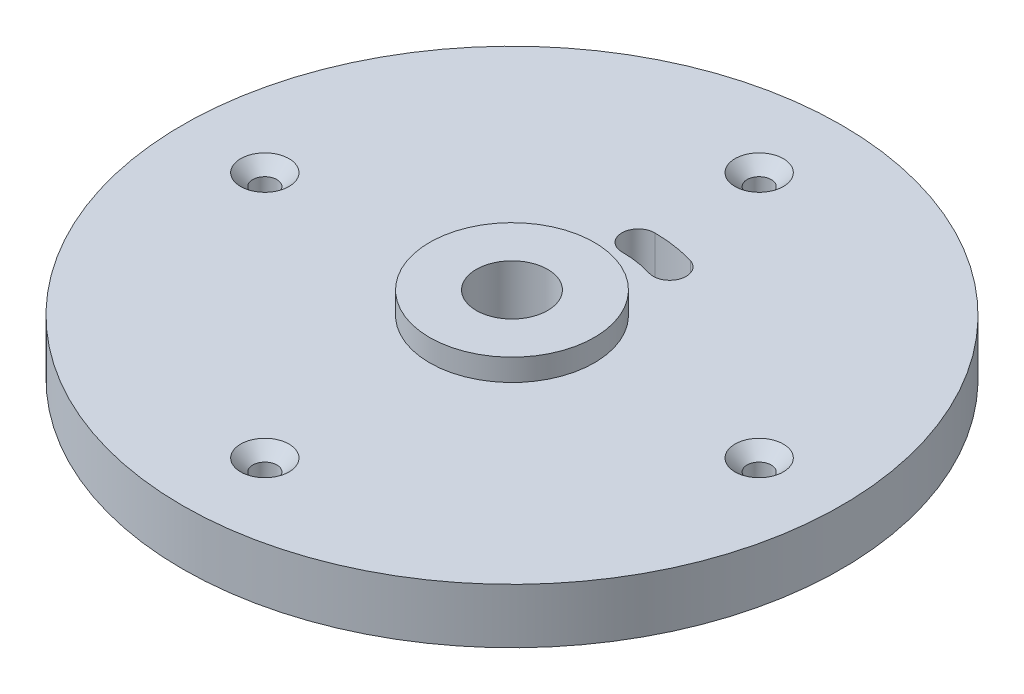
ISO-10303-21;
HEADER;
FILE_DESCRIPTION(('STEP AP214'),'2;1');
FILE_NAME('part.step','',(''),(''),'','','');
FILE_SCHEMA(('AUTOMOTIVE_DESIGN { 1 0 10303 214 1 1 1 1 }'));
ENDSEC;
DATA;
#1=APPLICATION_CONTEXT('core data for automotive mechanical design processes');
#2=APPLICATION_PROTOCOL_DEFINITION('international standard','automotive_design',2000,#1);
#3=PRODUCT_CONTEXT('',#1,'mechanical');
#4=PRODUCT('Part','Part','',(#3));
#5=PRODUCT_RELATED_PRODUCT_CATEGORY('part','',(#4));
#6=PRODUCT_DEFINITION_FORMATION('','',#4);
#7=PRODUCT_DEFINITION_CONTEXT('part definition',#1,'design');
#8=PRODUCT_DEFINITION('design','',#6,#7);
#9=PRODUCT_DEFINITION_SHAPE('','',#8);
#10=(LENGTH_UNIT() NAMED_UNIT(*) SI_UNIT(.MILLI.,.METRE.));
#11=(NAMED_UNIT(*) PLANE_ANGLE_UNIT() SI_UNIT($,.RADIAN.));
#12=(NAMED_UNIT(*) SI_UNIT($,.STERADIAN.) SOLID_ANGLE_UNIT());
#13=UNCERTAINTY_MEASURE_WITH_UNIT(LENGTH_MEASURE(1.E-05),#10,'distance_accuracy_value','');
#14=(GEOMETRIC_REPRESENTATION_CONTEXT(3) GLOBAL_UNCERTAINTY_ASSIGNED_CONTEXT((#13)) GLOBAL_UNIT_ASSIGNED_CONTEXT((#10,
#11,#12)) REPRESENTATION_CONTEXT('',''));
#15=CARTESIAN_POINT('',(0.,0.,0.));
#16=DIRECTION('',(0.,0.,1.));
#17=DIRECTION('',(1.,0.,0.));
#18=AXIS2_PLACEMENT_3D('',#15,#16,#17);
#19=CARTESIAN_POINT('',(30.,14.,0.));
#20=DIRECTION('',(0.,1.,0.));
#21=DIRECTION('',(0.,0.,1.));
#22=AXIS2_PLACEMENT_3D('',#19,#20,#21);
#23=PLANE('',#22);
#24=CARTESIAN_POINT('',(-22.5,14.,7.07024971115735E-13));
#25=DIRECTION('',(0.,1.,0.));
#26=DIRECTION('',(0.,0.,1.));
#27=AXIS2_PLACEMENT_3D('',#24,#25,#26);
#28=CIRCLE('',#27,2.2);
#29=CARTESIAN_POINT('',(-22.5,14.,2.20000000000071));
#30=VERTEX_POINT('',#29);
#31=EDGE_CURVE('E148',#30,#30,#28,.T.);
#32=ORIENTED_EDGE('',*,*,#31,.F.);
#33=EDGE_LOOP('',(#32));
#34=FACE_BOUND('',#33,.T.);
#35=CARTESIAN_POINT('',(0.,14.,22.5));
#36=DIRECTION('',(0.,1.,0.));
#37=DIRECTION('',(0.,0.,1.));
#38=AXIS2_PLACEMENT_3D('',#35,#36,#37);
#39=CIRCLE('',#38,2.2);
#40=CARTESIAN_POINT('',(0.,14.,24.7));
#41=VERTEX_POINT('',#40);
#42=EDGE_CURVE('E152',#41,#41,#39,.T.);
#43=ORIENTED_EDGE('',*,*,#42,.F.);
#44=EDGE_LOOP('',(#43));
#45=FACE_BOUND('',#44,.T.);
#46=CARTESIAN_POINT('',(22.5,14.,-2.35674990371912E-13));
#47=DIRECTION('',(0.,1.,0.));
#48=DIRECTION('',(0.,0.,1.));
#49=AXIS2_PLACEMENT_3D('',#46,#47,#48);
#50=CIRCLE('',#49,2.2);
#51=CARTESIAN_POINT('',(22.5,14.,2.19999999999977));
#52=VERTEX_POINT('',#51);
#53=EDGE_CURVE('E156',#52,#52,#50,.T.);
#54=ORIENTED_EDGE('',*,*,#53,.F.);
#55=EDGE_LOOP('',(#54));
#56=FACE_BOUND('',#55,.T.);
#57=CARTESIAN_POINT('',(0.,14.,-22.5));
#58=DIRECTION('',(0.,1.,0.));
#59=DIRECTION('',(0.,0.,1.));
#60=AXIS2_PLACEMENT_3D('',#57,#58,#59);
#61=CIRCLE('',#60,2.2);
#62=CARTESIAN_POINT('',(0.,14.,-20.3));
#63=VERTEX_POINT('',#62);
#64=EDGE_CURVE('E160',#63,#63,#61,.T.);
#65=ORIENTED_EDGE('',*,*,#64,.F.);
#66=EDGE_LOOP('',(#65));
#67=FACE_BOUND('',#66,.T.);
#68=CARTESIAN_POINT('',(0.,14.,0.));
#69=DIRECTION('',(0.,1.,0.));
#70=DIRECTION('',(0.,0.,1.));
#71=AXIS2_PLACEMENT_3D('',#68,#69,#70);
#72=CIRCLE('',#71,7.5);
#73=CARTESIAN_POINT('',(0.,14.,7.5));
#74=VERTEX_POINT('',#73);
#75=EDGE_CURVE('E11',#74,#74,#72,.T.);
#76=ORIENTED_EDGE('',*,*,#75,.F.);
#77=EDGE_LOOP('',(#76));
#78=FACE_BOUND('',#77,.T.);
#79=CARTESIAN_POINT('',(0.,14.,0.));
#80=DIRECTION('',(0.,1.,0.));
#81=DIRECTION('',(0.,0.,1.));
#82=AXIS2_PLACEMENT_3D('',#79,#80,#81);
#83=CIRCLE('',#82,10.);
#84=CARTESIAN_POINT('',(0.,14.,-10.));
#85=VERTEX_POINT('',#84);
#86=CARTESIAN_POINT('',(2.9237170472273,14.,-9.56304755963038));
#87=VERTEX_POINT('',#86);
#88=EDGE_CURVE('E106',#85,#87,#83,.F.);
#89=ORIENTED_EDGE('',*,*,#88,.F.);
#90=CARTESIAN_POINT('',(0.,14.,-11.5));
#91=DIRECTION('',(0.,1.,0.));
#92=DIRECTION('',(0.,0.,1.));
#93=AXIS2_PLACEMENT_3D('',#90,#91,#92);
#94=CIRCLE('',#93,1.5);
#95=CARTESIAN_POINT('',(0.,14.,-13.));
#96=VERTEX_POINT('',#95);
#97=EDGE_CURVE('E109',#96,#85,#94,.T.);
#98=ORIENTED_EDGE('',*,*,#97,.F.);
#99=CARTESIAN_POINT('',(0.,14.,0.));
#100=DIRECTION('',(0.,1.,0.));
#101=DIRECTION('',(0.,0.,1.));
#102=AXIS2_PLACEMENT_3D('',#99,#100,#101);
#103=CIRCLE('',#102,13.);
#104=CARTESIAN_POINT('',(3.80083216139549,14.,-12.4319618275195));
#105=VERTEX_POINT('',#104);
#106=EDGE_CURVE('E90',#105,#96,#103,.T.);
#107=ORIENTED_EDGE('',*,*,#106,.F.);
#108=CARTESIAN_POINT('',(3.3622746043114,14.,-10.9975046935749));
#109=DIRECTION('',(0.,1.,0.));
#110=DIRECTION('',(0.,0.,1.));
#111=AXIS2_PLACEMENT_3D('',#108,#109,#110);
#112=CIRCLE('',#111,1.5);
#113=EDGE_CURVE('E50',#87,#105,#112,.T.);
#114=ORIENTED_EDGE('',*,*,#113,.F.);
#115=EDGE_LOOP('',(#89,#98,#107,#114));
#116=FACE_BOUND('',#115,.T.);
#117=CARTESIAN_POINT('',(0.,14.,0.));
#118=DIRECTION('',(0.,-1.,0.));
#119=DIRECTION('',(0.,0.,-1.));
#120=AXIS2_PLACEMENT_3D('',#117,#118,#119);
#121=CIRCLE('',#120,30.);
#122=CARTESIAN_POINT('',(0.,14.,-30.));
#123=VERTEX_POINT('',#122);
#124=EDGE_CURVE('E116',#123,#123,#121,.T.);
#125=ORIENTED_EDGE('',*,*,#124,.F.);
#126=EDGE_LOOP('',(#125));
#127=FACE_BOUND('',#126,.T.);
#128=ADVANCED_FACE('F35',(#34,#45,#56,#67,#78,#116,#127),#23,.T.);
#129=CARTESIAN_POINT('',(15.,6.3,0.));
#130=DIRECTION('',(0.,-1.,0.));
#131=DIRECTION('',(0.,0.,-1.));
#132=AXIS2_PLACEMENT_3D('',#129,#130,#131);
#133=PLANE('',#132);
#134=CARTESIAN_POINT('',(0.,6.3,0.));
#135=DIRECTION('',(0.,-1.,0.));
#136=DIRECTION('',(0.,0.,-1.));
#137=AXIS2_PLACEMENT_3D('',#134,#135,#136);
#138=CIRCLE('',#137,13.);
#139=CARTESIAN_POINT('',(0.,6.3,-13.));
#140=VERTEX_POINT('',#139);
#141=CARTESIAN_POINT('',(3.80083216139549,6.3,-12.4319618275195));
#142=VERTEX_POINT('',#141);
#143=EDGE_CURVE('E87',#140,#142,#138,.T.);
#144=ORIENTED_EDGE('',*,*,#143,.F.);
#145=CARTESIAN_POINT('',(0.,6.3,-11.5));
#146=DIRECTION('',(0.,-1.,0.));
#147=DIRECTION('',(0.,0.,-1.));
#148=AXIS2_PLACEMENT_3D('',#145,#146,#147);
#149=CIRCLE('',#148,1.5);
#150=CARTESIAN_POINT('',(0.,6.3,-10.));
#151=VERTEX_POINT('',#150);
#152=EDGE_CURVE('E58',#151,#140,#149,.T.);
#153=ORIENTED_EDGE('',*,*,#152,.F.);
#154=CARTESIAN_POINT('',(0.,6.3,0.));
#155=DIRECTION('',(0.,-1.,0.));
#156=DIRECTION('',(0.,0.,-1.));
#157=AXIS2_PLACEMENT_3D('',#154,#155,#156);
#158=CIRCLE('',#157,10.);
#159=CARTESIAN_POINT('',(2.9237170472273,6.3,-9.56304755963038));
#160=VERTEX_POINT('',#159);
#161=EDGE_CURVE('E96',#160,#151,#158,.F.);
#162=ORIENTED_EDGE('',*,*,#161,.F.);
#163=CARTESIAN_POINT('',(3.3622746043114,6.3,-10.9975046935749));
#164=DIRECTION('',(0.,-1.,0.));
#165=DIRECTION('',(0.,0.,-1.));
#166=AXIS2_PLACEMENT_3D('',#163,#164,#165);
#167=CIRCLE('',#166,1.5);
#168=EDGE_CURVE('E78',#142,#160,#167,.T.);
#169=ORIENTED_EDGE('',*,*,#168,.F.);
#170=EDGE_LOOP('',(#144,#153,#162,#169));
#171=FACE_BOUND('',#170,.T.);
#172=CARTESIAN_POINT('',(0.,6.3,0.));
#173=DIRECTION('',(0.,-1.,0.));
#174=DIRECTION('',(0.,0.,-1.));
#175=AXIS2_PLACEMENT_3D('',#172,#173,#174);
#176=CIRCLE('',#175,15.);
#177=CARTESIAN_POINT('',(0.,6.3,-15.));
#178=VERTEX_POINT('',#177);
#179=EDGE_CURVE('E38',#178,#178,#176,.T.);
#180=ORIENTED_EDGE('',*,*,#179,.T.);
#181=EDGE_LOOP('',(#180));
#182=FACE_BOUND('',#181,.T.);
#183=CARTESIAN_POINT('',(0.,6.3,0.));
#184=DIRECTION('',(0.,1.,0.));
#185=DIRECTION('',(0.,0.,1.));
#186=AXIS2_PLACEMENT_3D('',#183,#184,#185);
#187=CIRCLE('',#186,3.25);
#188=CARTESIAN_POINT('',(0.,6.3,3.25));
#189=VERTEX_POINT('',#188);
#190=EDGE_CURVE('E97',#189,#189,#187,.T.);
#191=ORIENTED_EDGE('',*,*,#190,.T.);
#192=EDGE_LOOP('',(#191));
#193=FACE_BOUND('',#192,.T.);
#194=ADVANCED_FACE('F93',(#171,#182,#193),#133,.T.);
#195=CARTESIAN_POINT('',(0.,0.,0.));
#196=DIRECTION('',(0.,-1.,0.));
#197=DIRECTION('',(0.,0.,-1.));
#198=AXIS2_PLACEMENT_3D('',#195,#196,#197);
#199=CYLINDRICAL_SURFACE('',#198,15.);
#200=CARTESIAN_POINT('',(0.,9.,0.));
#201=DIRECTION('',(0.,-1.,0.));
#202=DIRECTION('',(0.,0.,-1.));
#203=AXIS2_PLACEMENT_3D('',#200,#201,#202);
#204=CIRCLE('',#203,15.);
#205=CARTESIAN_POINT('',(0.,9.,-15.));
#206=VERTEX_POINT('',#205);
#207=EDGE_CURVE('E121',#206,#206,#204,.T.);
#208=ORIENTED_EDGE('',*,*,#207,.T.);
#209=EDGE_LOOP('',(#208));
#210=FACE_BOUND('',#209,.T.);
#211=ORIENTED_EDGE('',*,*,#179,.F.);
#212=EDGE_LOOP('',(#211));
#213=FACE_BOUND('',#212,.T.);
#214=ADVANCED_FACE('F129',(#210,#213),#199,.T.);
#215=CARTESIAN_POINT('',(15.,9.,0.));
#216=DIRECTION('',(0.,-1.,0.));
#217=DIRECTION('',(0.,0.,-1.));
#218=AXIS2_PLACEMENT_3D('',#215,#216,#217);
#219=PLANE('',#218);
#220=CARTESIAN_POINT('',(-22.5,8.99999999999999,7.07024971115735E-13));
#221=DIRECTION('',(0.,1.,0.));
#222=DIRECTION('',(0.,0.,1.));
#223=AXIS2_PLACEMENT_3D('',#220,#221,#222);
#224=CIRCLE('',#223,1.09999999999999);
#225=CARTESIAN_POINT('',(-22.5,8.99999999999999,1.1000000000007));
#226=VERTEX_POINT('',#225);
#227=EDGE_CURVE('E235',#226,#226,#224,.T.);
#228=ORIENTED_EDGE('',*,*,#227,.T.);
#229=EDGE_LOOP('',(#228));
#230=FACE_BOUND('',#229,.T.);
#231=CARTESIAN_POINT('',(0.,8.99999999999999,22.5));
#232=DIRECTION('',(0.,1.,0.));
#233=DIRECTION('',(0.,0.,1.));
#234=AXIS2_PLACEMENT_3D('',#231,#232,#233);
#235=CIRCLE('',#234,1.09999999999999);
#236=CARTESIAN_POINT('',(0.,8.99999999999999,23.6));
#237=VERTEX_POINT('',#236);
#238=EDGE_CURVE('E244',#237,#237,#235,.T.);
#239=ORIENTED_EDGE('',*,*,#238,.T.);
#240=EDGE_LOOP('',(#239));
#241=FACE_BOUND('',#240,.T.);
#242=CARTESIAN_POINT('',(22.5,8.99999999999999,-2.35674990371912E-13));
#243=DIRECTION('',(0.,1.,0.));
#244=DIRECTION('',(0.,0.,1.));
#245=AXIS2_PLACEMENT_3D('',#242,#243,#244);
#246=CIRCLE('',#245,1.09999999999999);
#247=CARTESIAN_POINT('',(22.5,8.99999999999999,1.09999999999975));
#248=VERTEX_POINT('',#247);
#249=EDGE_CURVE('E251',#248,#248,#246,.T.);
#250=ORIENTED_EDGE('',*,*,#249,.T.);
#251=EDGE_LOOP('',(#250));
#252=FACE_BOUND('',#251,.T.);
#253=CARTESIAN_POINT('',(0.,8.99999999999999,-22.5));
#254=DIRECTION('',(0.,1.,0.));
#255=DIRECTION('',(0.,0.,1.));
#256=AXIS2_PLACEMENT_3D('',#253,#254,#255);
#257=CIRCLE('',#256,1.09999999999999);
#258=CARTESIAN_POINT('',(0.,8.99999999999999,-21.4));
#259=VERTEX_POINT('',#258);
#260=EDGE_CURVE('E258',#259,#259,#257,.T.);
#261=ORIENTED_EDGE('',*,*,#260,.T.);
#262=EDGE_LOOP('',(#261));
#263=FACE_BOUND('',#262,.T.);
#264=CARTESIAN_POINT('',(0.,9.,0.));
#265=DIRECTION('',(0.,-1.,0.));
#266=DIRECTION('',(0.,0.,-1.));
#267=AXIS2_PLACEMENT_3D('',#264,#265,#266);
#268=CIRCLE('',#267,30.);
#269=CARTESIAN_POINT('',(0.,9.,-30.));
#270=VERTEX_POINT('',#269);
#271=EDGE_CURVE('E119',#270,#270,#268,.T.);
#272=ORIENTED_EDGE('',*,*,#271,.T.);
#273=EDGE_LOOP('',(#272));
#274=FACE_BOUND('',#273,.T.);
#275=ORIENTED_EDGE('',*,*,#207,.F.);
#276=EDGE_LOOP('',(#275));
#277=FACE_BOUND('',#276,.T.);
#278=ADVANCED_FACE('F131',(#230,#241,#252,#263,#274,#277),#219,.T.);
#279=CARTESIAN_POINT('',(0.,0.,0.));
#280=DIRECTION('',(0.,-1.,0.));
#281=DIRECTION('',(0.,0.,-1.));
#282=AXIS2_PLACEMENT_3D('',#279,#280,#281);
#283=CYLINDRICAL_SURFACE('',#282,30.);
#284=ORIENTED_EDGE('',*,*,#124,.T.);
#285=EDGE_LOOP('',(#284));
#286=FACE_BOUND('',#285,.T.);
#287=ORIENTED_EDGE('',*,*,#271,.F.);
#288=EDGE_LOOP('',(#287));
#289=FACE_BOUND('',#288,.T.);
#290=ADVANCED_FACE('F137',(#286,#289),#283,.T.);
#291=CARTESIAN_POINT('',(0.,14.001,-11.5));
#292=DIRECTION('',(0.,-1.,0.));
#293=DIRECTION('',(0.,0.,-1.));
#294=AXIS2_PLACEMENT_3D('',#291,#292,#293);
#295=CYLINDRICAL_SURFACE('',#294,1.5);
#296=ORIENTED_EDGE('',*,*,#97,.T.);
#297=DIRECTION('',(0.,-1.,0.));
#298=VECTOR('',#297,1.);
#299=CARTESIAN_POINT('',(0.,14.001,-10.));
#300=LINE('',#299,#298);
#301=EDGE_CURVE('E91',#85,#151,#300,.T.);
#302=ORIENTED_EDGE('',*,*,#301,.T.);
#303=ORIENTED_EDGE('',*,*,#152,.T.);
#304=DIRECTION('',(0.,-1.,0.));
#305=VECTOR('',#304,1.);
#306=CARTESIAN_POINT('',(0.,14.001,-13.));
#307=LINE('',#306,#305);
#308=EDGE_CURVE('E84',#96,#140,#307,.T.);
#309=ORIENTED_EDGE('',*,*,#308,.F.);
#310=EDGE_LOOP('',(#296,#302,#303,#309));
#311=FACE_BOUND('',#310,.T.);
#312=ADVANCED_FACE('F170',(#311),#295,.F.);
#313=CARTESIAN_POINT('',(0.,14.001,0.));
#314=DIRECTION('',(0.,-1.,0.));
#315=DIRECTION('',(0.,0.,-1.));
#316=AXIS2_PLACEMENT_3D('',#313,#314,#315);
#317=CYLINDRICAL_SURFACE('',#316,10.);
#318=ORIENTED_EDGE('',*,*,#88,.T.);
#319=DIRECTION('',(0.,-1.,0.));
#320=VECTOR('',#319,1.);
#321=CARTESIAN_POINT('',(2.9237170472273,14.001,-9.56304755963038));
#322=LINE('',#321,#320);
#323=EDGE_CURVE('E83',#87,#160,#322,.T.);
#324=ORIENTED_EDGE('',*,*,#323,.T.);
#325=ORIENTED_EDGE('',*,*,#161,.T.);
#326=ORIENTED_EDGE('',*,*,#301,.F.);
#327=EDGE_LOOP('',(#318,#324,#325,#326));
#328=FACE_BOUND('',#327,.T.);
#329=ADVANCED_FACE('F178',(#328),#317,.T.);
#330=CARTESIAN_POINT('',(3.3622746043114,14.001,-10.9975046935749));
#331=DIRECTION('',(0.,-1.,0.));
#332=DIRECTION('',(0.,0.,-1.));
#333=AXIS2_PLACEMENT_3D('',#330,#331,#332);
#334=CYLINDRICAL_SURFACE('',#333,1.5);
#335=ORIENTED_EDGE('',*,*,#113,.T.);
#336=DIRECTION('',(0.,-1.,0.));
#337=VECTOR('',#336,1.);
#338=CARTESIAN_POINT('',(3.80083216139549,14.001,-12.4319618275195));
#339=LINE('',#338,#337);
#340=EDGE_CURVE('E74',#105,#142,#339,.T.);
#341=ORIENTED_EDGE('',*,*,#340,.T.);
#342=ORIENTED_EDGE('',*,*,#168,.T.);
#343=ORIENTED_EDGE('',*,*,#323,.F.);
#344=EDGE_LOOP('',(#335,#341,#342,#343));
#345=FACE_BOUND('',#344,.T.);
#346=ADVANCED_FACE('F76',(#345),#334,.F.);
#347=CARTESIAN_POINT('',(0.,14.001,0.));
#348=DIRECTION('',(0.,-1.,0.));
#349=DIRECTION('',(0.,0.,-1.));
#350=AXIS2_PLACEMENT_3D('',#347,#348,#349);
#351=CYLINDRICAL_SURFACE('',#350,13.);
#352=ORIENTED_EDGE('',*,*,#106,.T.);
#353=ORIENTED_EDGE('',*,*,#308,.T.);
#354=ORIENTED_EDGE('',*,*,#143,.T.);
#355=ORIENTED_EDGE('',*,*,#340,.F.);
#356=EDGE_LOOP('',(#352,#353,#354,#355));
#357=FACE_BOUND('',#356,.T.);
#358=ADVANCED_FACE('F88',(#357),#351,.F.);
#359=CARTESIAN_POINT('',(0.,0.,0.));
#360=DIRECTION('',(0.,-1.,0.));
#361=DIRECTION('',(0.,0.,-1.));
#362=AXIS2_PLACEMENT_3D('',#359,#360,#361);
#363=CYLINDRICAL_SURFACE('',#362,3.25);
#364=ORIENTED_EDGE('',*,*,#190,.F.);
#365=EDGE_LOOP('',(#364));
#366=FACE_BOUND('',#365,.T.);
#367=CARTESIAN_POINT('',(0.,16.,0.));
#368=DIRECTION('',(0.,1.,0.));
#369=DIRECTION('',(0.,0.,1.));
#370=AXIS2_PLACEMENT_3D('',#367,#368,#369);
#371=CIRCLE('',#370,3.25);
#372=CARTESIAN_POINT('',(0.,16.,3.25));
#373=VERTEX_POINT('',#372);
#374=EDGE_CURVE('E261',#373,#373,#371,.T.);
#375=ORIENTED_EDGE('',*,*,#374,.T.);
#376=EDGE_LOOP('',(#375));
#377=FACE_BOUND('',#376,.T.);
#378=ADVANCED_FACE('F188',(#366,#377),#363,.F.);
#379=CARTESIAN_POINT('',(0.,6.3,0.));
#380=DIRECTION('',(0.,1.,0.));
#381=DIRECTION('',(0.,0.,1.));
#382=AXIS2_PLACEMENT_3D('',#379,#380,#381);
#383=CYLINDRICAL_SURFACE('',#382,7.5);
#384=CARTESIAN_POINT('',(0.,16.,0.));
#385=DIRECTION('',(0.,1.,0.));
#386=DIRECTION('',(0.,0.,1.));
#387=AXIS2_PLACEMENT_3D('',#384,#385,#386);
#388=CIRCLE('',#387,7.5);
#389=CARTESIAN_POINT('',(0.,16.,7.5));
#390=VERTEX_POINT('',#389);
#391=EDGE_CURVE('E101',#390,#390,#388,.T.);
#392=CARTESIAN_POINT('',(0.,14.,7.5));
#393=CARTESIAN_POINT('',(0.,14.0208333333333,7.5));
#394=CARTESIAN_POINT('',(0.,14.0416666666667,7.5));
#395=CARTESIAN_POINT('',(0.,14.0833333333333,7.5));
#396=CARTESIAN_POINT('',(0.,14.1041666666667,7.5));
#397=CARTESIAN_POINT('',(0.,14.1458333333333,7.5));
#398=CARTESIAN_POINT('',(0.,14.1666666666667,7.5));
#399=CARTESIAN_POINT('',(0.,14.2083333333333,7.5));
#400=CARTESIAN_POINT('',(0.,14.2291666666667,7.5));
#401=CARTESIAN_POINT('',(0.,14.2708333333333,7.5));
#402=CARTESIAN_POINT('',(0.,14.2916666666667,7.5));
#403=CARTESIAN_POINT('',(0.,14.3333333333333,7.5));
#404=CARTESIAN_POINT('',(0.,14.3541666666667,7.5));
#405=CARTESIAN_POINT('',(0.,14.3958333333333,7.5));
#406=CARTESIAN_POINT('',(0.,14.4166666666667,7.5));
#407=CARTESIAN_POINT('',(0.,14.4583333333333,7.5));
#408=CARTESIAN_POINT('',(0.,14.4791666666667,7.5));
#409=CARTESIAN_POINT('',(0.,14.5208333333333,7.5));
#410=CARTESIAN_POINT('',(0.,14.5416666666667,7.5));
#411=CARTESIAN_POINT('',(0.,14.5833333333333,7.5));
#412=CARTESIAN_POINT('',(0.,14.6041666666667,7.5));
#413=CARTESIAN_POINT('',(0.,14.6458333333333,7.5));
#414=CARTESIAN_POINT('',(0.,14.6666666666667,7.5));
#415=CARTESIAN_POINT('',(0.,14.7083333333333,7.5));
#416=CARTESIAN_POINT('',(0.,14.7291666666667,7.5));
#417=CARTESIAN_POINT('',(0.,14.7708333333333,7.5));
#418=CARTESIAN_POINT('',(0.,14.7916666666667,7.5));
#419=CARTESIAN_POINT('',(0.,14.8333333333333,7.5));
#420=CARTESIAN_POINT('',(0.,14.8541666666667,7.5));
#421=CARTESIAN_POINT('',(0.,14.8958333333333,7.5));
#422=CARTESIAN_POINT('',(0.,14.9166666666667,7.5));
#423=CARTESIAN_POINT('',(0.,14.9583333333333,7.5));
#424=CARTESIAN_POINT('',(0.,14.9791666666667,7.5));
#425=CARTESIAN_POINT('',(0.,15.0208333333333,7.5));
#426=CARTESIAN_POINT('',(0.,15.0416666666667,7.5));
#427=CARTESIAN_POINT('',(0.,15.0833333333333,7.5));
#428=CARTESIAN_POINT('',(0.,15.1041666666667,7.5));
#429=CARTESIAN_POINT('',(0.,15.1458333333333,7.5));
#430=CARTESIAN_POINT('',(0.,15.1666666666667,7.5));
#431=CARTESIAN_POINT('',(0.,15.2083333333333,7.5));
#432=CARTESIAN_POINT('',(0.,15.2291666666667,7.5));
#433=CARTESIAN_POINT('',(0.,15.2708333333333,7.5));
#434=CARTESIAN_POINT('',(0.,15.2916666666667,7.5));
#435=CARTESIAN_POINT('',(0.,15.3333333333333,7.5));
#436=CARTESIAN_POINT('',(0.,15.3541666666667,7.5));
#437=CARTESIAN_POINT('',(0.,15.3958333333333,7.5));
#438=CARTESIAN_POINT('',(0.,15.4166666666667,7.5));
#439=CARTESIAN_POINT('',(0.,15.4583333333333,7.5));
#440=CARTESIAN_POINT('',(0.,15.4791666666667,7.5));
#441=CARTESIAN_POINT('',(0.,15.5208333333333,7.5));
#442=CARTESIAN_POINT('',(0.,15.5416666666667,7.5));
#443=CARTESIAN_POINT('',(0.,15.5833333333333,7.5));
#444=CARTESIAN_POINT('',(0.,15.6041666666667,7.5));
#445=CARTESIAN_POINT('',(0.,15.6458333333333,7.5));
#446=CARTESIAN_POINT('',(0.,15.6666666666667,7.5));
#447=CARTESIAN_POINT('',(0.,15.7083333333333,7.5));
#448=CARTESIAN_POINT('',(0.,15.7291666666667,7.5));
#449=CARTESIAN_POINT('',(0.,15.7708333333333,7.5));
#450=CARTESIAN_POINT('',(0.,15.7916666666667,7.5));
#451=CARTESIAN_POINT('',(0.,15.8333333333333,7.5));
#452=CARTESIAN_POINT('',(0.,15.8541666666667,7.5));
#453=CARTESIAN_POINT('',(0.,15.8958333333333,7.5));
#454=CARTESIAN_POINT('',(0.,15.9166666666667,7.5));
#455=CARTESIAN_POINT('',(0.,15.9583333333333,7.5));
#456=CARTESIAN_POINT('',(0.,15.9791666666667,7.5));
#457=CARTESIAN_POINT('',(0.,16.,7.5));
#458=B_SPLINE_CURVE_WITH_KNOTS('',3,(#392,#393,#394,#395,#396,#397,#398,#399,#400,#401,#402,
#403,#404,#405,#406,#407,#408,#409,#410,#411,#412,#413,#414,#415,#416,#417,#418,#419,#420,#421,
#422,#423,#424,#425,#426,#427,#428,#429,#430,#431,#432,#433,#434,#435,#436,#437,#438,#439,#440,
#441,#442,#443,#444,#445,#446,#447,#448,#449,#450,#451,#452,#453,#454,#455,#456,#457),
.UNSPECIFIED.,.F.,.F.,(4,2,2,2,2,2,2,2,2,2,2,2,2,2,2,2,2,2,2,2,2,2,2,2,2,2,2,2,2,2,2,2,4),(0.,
0.0625000000000001,0.125,0.1875,0.25,0.3125,0.375,0.4375,0.5,0.5625,0.625000000000001,
0.687500000000001,0.750000000000001,0.812500000000001,0.875000000000001,0.937499999999999,
0.999999999999999,1.0625,1.125,1.1875,1.25,1.3125,1.375,1.4375,1.5,1.5625,1.625,1.6875,1.75,
1.8125,1.875,1.9375,2.),.UNSPECIFIED.);
#459=EDGE_CURVE('BSEAM189',#74,#390,#458,.T.);
#460=ORIENTED_EDGE('',*,*,#75,.T.);
#461=ORIENTED_EDGE('',*,*,#391,.F.);
#462=ORIENTED_EDGE('',*,*,#459,.T.);
#463=ORIENTED_EDGE('',*,*,#459,.F.);
#464=EDGE_LOOP('',(#460,#462,#461,#463));
#465=FACE_BOUND('',#464,.T.);
#466=ADVANCED_FACE('F189',(#465),#383,.T.);
#467=CARTESIAN_POINT('',(0.,16.,0.));
#468=DIRECTION('',(0.,1.,0.));
#469=DIRECTION('',(0.,0.,1.));
#470=AXIS2_PLACEMENT_3D('',#467,#468,#469);
#471=PLANE('',#470);
#472=ORIENTED_EDGE('',*,*,#391,.T.);
#473=EDGE_LOOP('',(#472));
#474=FACE_BOUND('',#473,.T.);
#475=ORIENTED_EDGE('',*,*,#374,.F.);
#476=EDGE_LOOP('',(#475));
#477=FACE_BOUND('',#476,.T.);
#478=ADVANCED_FACE('F192',(#474,#477),#471,.T.);
#479=CARTESIAN_POINT('',(0.,14.,-22.5));
#480=DIRECTION('',(0.,1.,0.));
#481=DIRECTION('',(0.,0.,1.));
#482=AXIS2_PLACEMENT_3D('',#479,#480,#481);
#483=CYLINDRICAL_SURFACE('',#482,1.09999999999999);
#484=ORIENTED_EDGE('',*,*,#260,.F.);
#485=EDGE_LOOP('',(#484));
#486=FACE_BOUND('',#485,.T.);
#487=CARTESIAN_POINT('',(0.,12.9,-22.5));
#488=DIRECTION('',(0.,1.,0.));
#489=DIRECTION('',(0.,0.,1.));
#490=AXIS2_PLACEMENT_3D('',#487,#488,#489);
#491=CIRCLE('',#490,1.1);
#492=CARTESIAN_POINT('',(0.,12.9,-21.4));
#493=VERTEX_POINT('',#492);
#494=EDGE_CURVE('E255',#493,#493,#491,.T.);
#495=ORIENTED_EDGE('',*,*,#494,.T.);
#496=EDGE_LOOP('',(#495));
#497=FACE_BOUND('',#496,.T.);
#498=ADVANCED_FACE('F196',(#486,#497),#483,.F.);
#499=CARTESIAN_POINT('',(0.,14.,-22.5));
#500=DIRECTION('',(0.,1.,0.));
#501=DIRECTION('',(0.,0.,1.));
#502=AXIS2_PLACEMENT_3D('',#499,#500,#501);
#503=CONICAL_SURFACE('',#502,2.2,0.785398163397448);
#504=ORIENTED_EDGE('',*,*,#494,.F.);
#505=EDGE_LOOP('',(#504));
#506=FACE_BOUND('',#505,.T.);
#507=ORIENTED_EDGE('',*,*,#64,.T.);
#508=EDGE_LOOP('',(#507));
#509=FACE_BOUND('',#508,.T.);
#510=ADVANCED_FACE('F200',(#506,#509),#503,.F.);
#511=CARTESIAN_POINT('',(22.5,14.,-2.35674990371912E-13));
#512=DIRECTION('',(0.,1.,0.));
#513=DIRECTION('',(0.,0.,1.));
#514=AXIS2_PLACEMENT_3D('',#511,#512,#513);
#515=CYLINDRICAL_SURFACE('',#514,1.09999999999999);
#516=ORIENTED_EDGE('',*,*,#249,.F.);
#517=EDGE_LOOP('',(#516));
#518=FACE_BOUND('',#517,.T.);
#519=CARTESIAN_POINT('',(22.5,12.9,-2.35674990371912E-13));
#520=DIRECTION('',(0.,1.,0.));
#521=DIRECTION('',(0.,0.,1.));
#522=AXIS2_PLACEMENT_3D('',#519,#520,#521);
#523=CIRCLE('',#522,1.1);
#524=CARTESIAN_POINT('',(22.5,12.9,1.09999999999976));
#525=VERTEX_POINT('',#524);
#526=EDGE_CURVE('E248',#525,#525,#523,.T.);
#527=ORIENTED_EDGE('',*,*,#526,.T.);
#528=EDGE_LOOP('',(#527));
#529=FACE_BOUND('',#528,.T.);
#530=ADVANCED_FACE('F204',(#518,#529),#515,.F.);
#531=CARTESIAN_POINT('',(22.5,14.,-2.35674990371912E-13));
#532=DIRECTION('',(0.,1.,0.));
#533=DIRECTION('',(0.,0.,1.));
#534=AXIS2_PLACEMENT_3D('',#531,#532,#533);
#535=CONICAL_SURFACE('',#534,2.2,0.785398163397448);
#536=ORIENTED_EDGE('',*,*,#526,.F.);
#537=EDGE_LOOP('',(#536));
#538=FACE_BOUND('',#537,.T.);
#539=ORIENTED_EDGE('',*,*,#53,.T.);
#540=EDGE_LOOP('',(#539));
#541=FACE_BOUND('',#540,.T.);
#542=ADVANCED_FACE('F208',(#538,#541),#535,.F.);
#543=CARTESIAN_POINT('',(0.,14.,22.5));
#544=DIRECTION('',(0.,1.,0.));
#545=DIRECTION('',(0.,0.,1.));
#546=AXIS2_PLACEMENT_3D('',#543,#544,#545);
#547=CYLINDRICAL_SURFACE('',#546,1.09999999999999);
#548=ORIENTED_EDGE('',*,*,#238,.F.);
#549=EDGE_LOOP('',(#548));
#550=FACE_BOUND('',#549,.T.);
#551=CARTESIAN_POINT('',(0.,12.9,22.5));
#552=DIRECTION('',(0.,1.,0.));
#553=DIRECTION('',(0.,0.,1.));
#554=AXIS2_PLACEMENT_3D('',#551,#552,#553);
#555=CIRCLE('',#554,1.1);
#556=CARTESIAN_POINT('',(0.,12.9,23.6));
#557=VERTEX_POINT('',#556);
#558=EDGE_CURVE('E241',#557,#557,#555,.T.);
#559=ORIENTED_EDGE('',*,*,#558,.T.);
#560=EDGE_LOOP('',(#559));
#561=FACE_BOUND('',#560,.T.);
#562=ADVANCED_FACE('F212',(#550,#561),#547,.F.);
#563=CARTESIAN_POINT('',(0.,14.,22.5));
#564=DIRECTION('',(0.,1.,0.));
#565=DIRECTION('',(0.,0.,1.));
#566=AXIS2_PLACEMENT_3D('',#563,#564,#565);
#567=CONICAL_SURFACE('',#566,2.2,0.785398163397448);
#568=ORIENTED_EDGE('',*,*,#558,.F.);
#569=EDGE_LOOP('',(#568));
#570=FACE_BOUND('',#569,.T.);
#571=ORIENTED_EDGE('',*,*,#42,.T.);
#572=EDGE_LOOP('',(#571));
#573=FACE_BOUND('',#572,.T.);
#574=ADVANCED_FACE('F216',(#570,#573),#567,.F.);
#575=CARTESIAN_POINT('',(-22.5,14.,7.07024971115735E-13));
#576=DIRECTION('',(0.,1.,0.));
#577=DIRECTION('',(0.,0.,1.));
#578=AXIS2_PLACEMENT_3D('',#575,#576,#577);
#579=CYLINDRICAL_SURFACE('',#578,1.09999999999999);
#580=ORIENTED_EDGE('',*,*,#227,.F.);
#581=EDGE_LOOP('',(#580));
#582=FACE_BOUND('',#581,.T.);
#583=CARTESIAN_POINT('',(-22.5,12.9,7.07024971115735E-13));
#584=DIRECTION('',(0.,1.,0.));
#585=DIRECTION('',(0.,0.,1.));
#586=AXIS2_PLACEMENT_3D('',#583,#584,#585);
#587=CIRCLE('',#586,1.1);
#588=CARTESIAN_POINT('',(-22.5,12.9,1.10000000000071));
#589=VERTEX_POINT('',#588);
#590=EDGE_CURVE('E233',#589,#589,#587,.T.);
#591=ORIENTED_EDGE('',*,*,#590,.T.);
#592=EDGE_LOOP('',(#591));
#593=FACE_BOUND('',#592,.T.);
#594=ADVANCED_FACE('F220',(#582,#593),#579,.F.);
#595=CARTESIAN_POINT('',(-22.5,14.,7.07024971115735E-13));
#596=DIRECTION('',(0.,1.,0.));
#597=DIRECTION('',(0.,0.,1.));
#598=AXIS2_PLACEMENT_3D('',#595,#596,#597);
#599=CONICAL_SURFACE('',#598,2.2,0.785398163397448);
#600=ORIENTED_EDGE('',*,*,#590,.F.);
#601=EDGE_LOOP('',(#600));
#602=FACE_BOUND('',#601,.T.);
#603=ORIENTED_EDGE('',*,*,#31,.T.);
#604=EDGE_LOOP('',(#603));
#605=FACE_BOUND('',#604,.T.);
#606=ADVANCED_FACE('F224',(#602,#605),#599,.F.);
#607=CLOSED_SHELL('',(#128,#194,#214,#278,#290,#312,#329,#346,#358,#378,#466,#478,#498,#510,
#530,#542,#562,#574,#594,#606));
#608=MANIFOLD_SOLID_BREP('B2',#607);
#609=ADVANCED_BREP_SHAPE_REPRESENTATION('',(#18,#608),#14);
#610=SHAPE_DEFINITION_REPRESENTATION(#9,#609);
ENDSEC;
END-ISO-10303-21;
